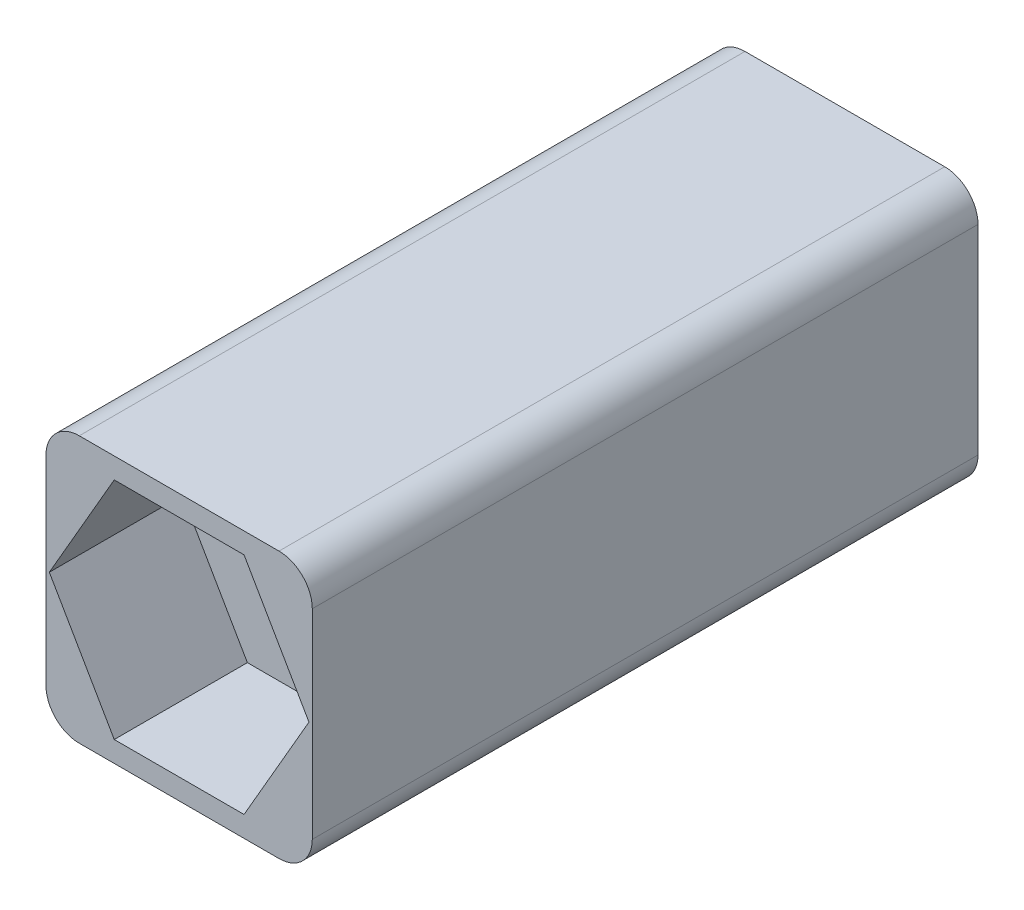
ISO-10303-21;
HEADER;
FILE_DESCRIPTION(('STEP AP214'),'2;1');
FILE_NAME('part.step','',(''),(''),'','','');
FILE_SCHEMA(('AUTOMOTIVE_DESIGN { 1 0 10303 214 1 1 1 1 }'));
ENDSEC;
DATA;
#1=APPLICATION_CONTEXT('core data for automotive mechanical design processes');
#2=APPLICATION_PROTOCOL_DEFINITION('international standard','automotive_design',2000,#1);
#3=PRODUCT_CONTEXT('',#1,'mechanical');
#4=PRODUCT('Part','Part','',(#3));
#5=PRODUCT_RELATED_PRODUCT_CATEGORY('part','',(#4));
#6=PRODUCT_DEFINITION_FORMATION('','',#4);
#7=PRODUCT_DEFINITION_CONTEXT('part definition',#1,'design');
#8=PRODUCT_DEFINITION('design','',#6,#7);
#9=PRODUCT_DEFINITION_SHAPE('','',#8);
#10=(LENGTH_UNIT() NAMED_UNIT(*) SI_UNIT(.MILLI.,.METRE.));
#11=(NAMED_UNIT(*) PLANE_ANGLE_UNIT() SI_UNIT($,.RADIAN.));
#12=(NAMED_UNIT(*) SI_UNIT($,.STERADIAN.) SOLID_ANGLE_UNIT());
#13=UNCERTAINTY_MEASURE_WITH_UNIT(LENGTH_MEASURE(1.E-05),#10,'distance_accuracy_value','');
#14=(GEOMETRIC_REPRESENTATION_CONTEXT(3) GLOBAL_UNCERTAINTY_ASSIGNED_CONTEXT((#13)) GLOBAL_UNIT_ASSIGNED_CONTEXT((#10,
#11,#12)) REPRESENTATION_CONTEXT('',''));
#15=CARTESIAN_POINT('',(0.,0.,0.));
#16=DIRECTION('',(0.,0.,1.));
#17=DIRECTION('',(1.,0.,0.));
#18=AXIS2_PLACEMENT_3D('',#15,#16,#17);
#19=CARTESIAN_POINT('',(1.39914914913894,0.658917954286227,0.));
#20=DIRECTION('',(0.,0.,1.));
#21=DIRECTION('',(1.,0.,0.));
#22=AXIS2_PLACEMENT_3D('',#19,#20,#21);
#23=CYLINDRICAL_SURFACE('',#22,2.);
#24=CARTESIAN_POINT('',(1.39914914913894,0.658917954286227,0.));
#25=DIRECTION('',(0.,0.,1.));
#26=DIRECTION('',(1.,0.,0.));
#27=AXIS2_PLACEMENT_3D('',#24,#25,#26);
#28=CIRCLE('',#27,2.);
#29=CARTESIAN_POINT('',(3.39914914913895,0.658917954286227,0.));
#30=VERTEX_POINT('',#29);
#31=EDGE_CURVE('E210',#30,#30,#28,.T.);
#32=ORIENTED_EDGE('',*,*,#31,.F.);
#33=EDGE_LOOP('',(#32));
#34=FACE_BOUND('',#33,.T.);
#35=CARTESIAN_POINT('',(1.39914914913894,0.658917954286227,16.));
#36=DIRECTION('',(0.,0.,1.));
#37=DIRECTION('',(1.,0.,0.));
#38=AXIS2_PLACEMENT_3D('',#35,#36,#37);
#39=CIRCLE('',#38,2.);
#40=CARTESIAN_POINT('',(3.39914914913895,0.658917954286227,16.));
#41=VERTEX_POINT('',#40);
#42=EDGE_CURVE('E169',#41,#41,#39,.F.);
#43=ORIENTED_EDGE('',*,*,#42,.F.);
#44=EDGE_LOOP('',(#43));
#45=FACE_BOUND('',#44,.T.);
#46=ADVANCED_FACE('F39',(#34,#45),#23,.F.);
#47=CARTESIAN_POINT('',(-2.60085085086106,4.65891795428623,20.));
#48=DIRECTION('',(1.,0.,0.));
#49=DIRECTION('',(0.,1.,0.));
#50=AXIS2_PLACEMENT_3D('',#47,#48,#49);
#51=PLANE('',#50);
#52=DIRECTION('',(0.,-1.,0.));
#53=VECTOR('',#52,1.);
#54=CARTESIAN_POINT('',(-2.60085085086106,4.65891795428623,0.));
#55=LINE('',#54,#53);
#56=CARTESIAN_POINT('',(-2.60085085086106,3.65891795428623,0.));
#57=VERTEX_POINT('',#56);
#58=CARTESIAN_POINT('',(-2.60085085086106,-2.34108204571377,0.));
#59=VERTEX_POINT('',#58);
#60=EDGE_CURVE('E225',#57,#59,#55,.T.);
#61=ORIENTED_EDGE('',*,*,#60,.T.);
#62=DIRECTION('',(0.,0.,-1.));
#63=VECTOR('',#62,1.);
#64=CARTESIAN_POINT('',(-2.60085085086106,-2.34108204571377,20.));
#65=LINE('',#64,#63);
#66=CARTESIAN_POINT('',(-2.60085085086106,-2.34108204571377,20.));
#67=VERTEX_POINT('',#66);
#68=EDGE_CURVE('E48',#59,#67,#65,.F.);
#69=ORIENTED_EDGE('',*,*,#68,.T.);
#70=DIRECTION('',(0.,-1.,0.));
#71=VECTOR('',#70,1.);
#72=CARTESIAN_POINT('',(-2.60085085086106,4.65891795428623,20.));
#73=LINE('',#72,#71);
#74=CARTESIAN_POINT('',(-2.60085085086106,3.65891795428623,20.));
#75=VERTEX_POINT('',#74);
#76=EDGE_CURVE('E226',#75,#67,#73,.T.);
#77=ORIENTED_EDGE('',*,*,#76,.F.);
#78=DIRECTION('',(0.,0.,-1.));
#79=VECTOR('',#78,1.);
#80=CARTESIAN_POINT('',(-2.60085085086106,3.65891795428623,20.));
#81=LINE('',#80,#79);
#82=EDGE_CURVE('E290',#75,#57,#81,.T.);
#83=ORIENTED_EDGE('',*,*,#82,.T.);
#84=EDGE_LOOP('',(#61,#69,#77,#83));
#85=FACE_BOUND('',#84,.T.);
#86=ADVANCED_FACE('F332',(#85),#51,.F.);
#87=CARTESIAN_POINT('',(-2.60085085086106,-3.34108204571377,20.));
#88=DIRECTION('',(0.,1.,0.));
#89=DIRECTION('',(0.,0.,1.));
#90=AXIS2_PLACEMENT_3D('',#87,#88,#89);
#91=PLANE('',#90);
#92=DIRECTION('',(1.,0.,0.));
#93=VECTOR('',#92,1.);
#94=CARTESIAN_POINT('',(-2.60085085086106,-3.34108204571377,20.));
#95=LINE('',#94,#93);
#96=CARTESIAN_POINT('',(-1.60085085086106,-3.34108204571377,20.));
#97=VERTEX_POINT('',#96);
#98=CARTESIAN_POINT('',(4.39914914913894,-3.34108204571377,20.));
#99=VERTEX_POINT('',#98);
#100=EDGE_CURVE('E229',#97,#99,#95,.T.);
#101=ORIENTED_EDGE('',*,*,#100,.F.);
#102=DIRECTION('',(0.,0.,-1.));
#103=VECTOR('',#102,1.);
#104=CARTESIAN_POINT('',(-1.60085085086106,-3.34108204571377,20.));
#105=LINE('',#104,#103);
#106=CARTESIAN_POINT('',(-1.60085085086106,-3.34108204571377,0.));
#107=VERTEX_POINT('',#106);
#108=EDGE_CURVE('E294',#97,#107,#105,.T.);
#109=ORIENTED_EDGE('',*,*,#108,.T.);
#110=DIRECTION('',(1.,0.,0.));
#111=VECTOR('',#110,1.);
#112=CARTESIAN_POINT('',(-2.60085085086106,-3.34108204571377,0.));
#113=LINE('',#112,#111);
#114=CARTESIAN_POINT('',(4.39914914913894,-3.34108204571377,0.));
#115=VERTEX_POINT('',#114);
#116=EDGE_CURVE('E244',#107,#115,#113,.T.);
#117=ORIENTED_EDGE('',*,*,#116,.T.);
#118=DIRECTION('',(0.,0.,-1.));
#119=VECTOR('',#118,1.);
#120=CARTESIAN_POINT('',(4.39914914913894,-3.34108204571377,20.));
#121=LINE('',#120,#119);
#122=EDGE_CURVE('E270',#115,#99,#121,.F.);
#123=ORIENTED_EDGE('',*,*,#122,.T.);
#124=EDGE_LOOP('',(#101,#109,#117,#123));
#125=FACE_BOUND('',#124,.T.);
#126=ADVANCED_FACE('F303',(#125),#91,.F.);
#127=CARTESIAN_POINT('',(5.39914914913894,4.65891795428623,20.));
#128=DIRECTION('',(-1.,0.,0.));
#129=DIRECTION('',(0.,0.,1.));
#130=AXIS2_PLACEMENT_3D('',#127,#128,#129);
#131=PLANE('',#130);
#132=DIRECTION('',(0.,1.,0.));
#133=VECTOR('',#132,1.);
#134=CARTESIAN_POINT('',(5.39914914913894,4.65891795428623,20.));
#135=LINE('',#134,#133);
#136=CARTESIAN_POINT('',(5.39914914913894,-2.34108204571377,20.));
#137=VERTEX_POINT('',#136);
#138=CARTESIAN_POINT('',(5.39914914913894,3.65891795428623,20.));
#139=VERTEX_POINT('',#138);
#140=EDGE_CURVE('E233',#137,#139,#135,.T.);
#141=ORIENTED_EDGE('',*,*,#140,.F.);
#142=DIRECTION('',(0.,0.,-1.));
#143=VECTOR('',#142,1.);
#144=CARTESIAN_POINT('',(5.39914914913894,-2.34108204571377,20.));
#145=LINE('',#144,#143);
#146=CARTESIAN_POINT('',(5.39914914913894,-2.34108204571377,0.));
#147=VERTEX_POINT('',#146);
#148=EDGE_CURVE('E256',#137,#147,#145,.T.);
#149=ORIENTED_EDGE('',*,*,#148,.T.);
#150=DIRECTION('',(0.,1.,0.));
#151=VECTOR('',#150,1.);
#152=CARTESIAN_POINT('',(5.39914914913894,4.65891795428623,0.));
#153=LINE('',#152,#151);
#154=CARTESIAN_POINT('',(5.39914914913894,3.65891795428623,0.));
#155=VERTEX_POINT('',#154);
#156=EDGE_CURVE('E247',#147,#155,#153,.T.);
#157=ORIENTED_EDGE('',*,*,#156,.T.);
#158=DIRECTION('',(0.,0.,-1.));
#159=VECTOR('',#158,1.);
#160=CARTESIAN_POINT('',(5.39914914913894,3.65891795428623,20.));
#161=LINE('',#160,#159);
#162=EDGE_CURVE('E241',#155,#139,#161,.F.);
#163=ORIENTED_EDGE('',*,*,#162,.T.);
#164=EDGE_LOOP('',(#141,#149,#157,#163));
#165=FACE_BOUND('',#164,.T.);
#166=ADVANCED_FACE('F318',(#165),#131,.F.);
#167=CARTESIAN_POINT('',(-2.60085085086106,4.65891795428623,20.));
#168=DIRECTION('',(0.,-1.,0.));
#169=DIRECTION('',(0.,0.,-1.));
#170=AXIS2_PLACEMENT_3D('',#167,#168,#169);
#171=PLANE('',#170);
#172=DIRECTION('',(-1.,0.,0.));
#173=VECTOR('',#172,1.);
#174=CARTESIAN_POINT('',(-2.60085085086106,4.65891795428623,20.));
#175=LINE('',#174,#173);
#176=CARTESIAN_POINT('',(4.39914914913894,4.65891795428623,20.));
#177=VERTEX_POINT('',#176);
#178=CARTESIAN_POINT('',(-1.60085085086106,4.65891795428623,20.));
#179=VERTEX_POINT('',#178);
#180=EDGE_CURVE('E237',#177,#179,#175,.T.);
#181=ORIENTED_EDGE('',*,*,#180,.F.);
#182=DIRECTION('',(0.,0.,-1.));
#183=VECTOR('',#182,1.);
#184=CARTESIAN_POINT('',(4.39914914913894,4.65891795428623,20.));
#185=LINE('',#184,#183);
#186=CARTESIAN_POINT('',(4.39914914913894,4.65891795428623,0.));
#187=VERTEX_POINT('',#186);
#188=EDGE_CURVE('E286',#177,#187,#185,.T.);
#189=ORIENTED_EDGE('',*,*,#188,.T.);
#190=DIRECTION('',(-1.,0.,0.));
#191=VECTOR('',#190,1.);
#192=CARTESIAN_POINT('',(-2.60085085086106,4.65891795428623,0.));
#193=LINE('',#192,#191);
#194=CARTESIAN_POINT('',(-1.60085085086106,4.65891795428623,0.));
#195=VERTEX_POINT('',#194);
#196=EDGE_CURVE('E230',#187,#195,#193,.T.);
#197=ORIENTED_EDGE('',*,*,#196,.T.);
#198=DIRECTION('',(0.,0.,-1.));
#199=VECTOR('',#198,1.);
#200=CARTESIAN_POINT('',(-1.60085085086106,4.65891795428623,20.));
#201=LINE('',#200,#199);
#202=EDGE_CURVE('E283',#195,#179,#201,.F.);
#203=ORIENTED_EDGE('',*,*,#202,.T.);
#204=EDGE_LOOP('',(#181,#189,#197,#203));
#205=FACE_BOUND('',#204,.T.);
#206=ADVANCED_FACE('F326',(#205),#171,.F.);
#207=CARTESIAN_POINT('',(0.,0.,20.));
#208=DIRECTION('',(0.,0.,1.));
#209=DIRECTION('',(1.,0.,0.));
#210=AXIS2_PLACEMENT_3D('',#207,#208,#209);
#211=PLANE('',#210);
#212=DIRECTION('',(-1.,0.,0.));
#213=VECTOR('',#212,1.);
#214=CARTESIAN_POINT('',(0.,4.03641702904554,20.));
#215=LINE('',#214,#213);
#216=CARTESIAN_POINT('',(3.34914914913895,4.03641702904554,20.));
#217=VERTEX_POINT('',#216);
#218=CARTESIAN_POINT('',(-0.550850850861056,4.03641702904554,20.));
#219=VERTEX_POINT('',#218);
#220=EDGE_CURVE('E148',#217,#219,#215,.T.);
#221=ORIENTED_EDGE('',*,*,#220,.F.);
#222=DIRECTION('',(-0.5,0.866025403784439,0.));
#223=VECTOR('',#222,1.);
#224=CARTESIAN_POINT('',(4.25968170556498,2.45932837937007,20.));
#225=LINE('',#224,#223);
#226=CARTESIAN_POINT('',(5.29914914913894,0.658917954286227,20.));
#227=VERTEX_POINT('',#226);
#228=EDGE_CURVE('E173',#227,#217,#225,.T.);
#229=ORIENTED_EDGE('',*,*,#228,.F.);
#230=DIRECTION('',(0.5,0.866025403784439,0.));
#231=VECTOR('',#230,1.);
#232=CARTESIAN_POINT('',(3.68904201814344,-2.12986940222695,20.));
#233=LINE('',#232,#231);
#234=CARTESIAN_POINT('',(3.34914914913894,-2.71858112047308,20.));
#235=VERTEX_POINT('',#234);
#236=EDGE_CURVE('E200',#235,#227,#233,.T.);
#237=ORIENTED_EDGE('',*,*,#236,.F.);
#238=DIRECTION('',(1.,0.,0.));
#239=VECTOR('',#238,1.);
#240=CARTESIAN_POINT('',(0.,-2.71858112047308,20.));
#241=LINE('',#240,#239);
#242=CARTESIAN_POINT('',(-0.550850850861054,-2.71858112047308,20.));
#243=VERTEX_POINT('',#242);
#244=EDGE_CURVE('E196',#243,#235,#241,.T.);
#245=ORIENTED_EDGE('',*,*,#244,.F.);
#246=DIRECTION('',(0.5,-0.866025403784439,0.));
#247=VECTOR('',#246,1.);
#248=CARTESIAN_POINT('',(-1.59031829443502,-0.918170695389245,20.));
#249=LINE('',#248,#247);
#250=CARTESIAN_POINT('',(-2.50085085086106,0.658917954286226,20.));
#251=VERTEX_POINT('',#250);
#252=EDGE_CURVE('E192',#251,#243,#249,.T.);
#253=ORIENTED_EDGE('',*,*,#252,.F.);
#254=DIRECTION('',(-0.5,-0.866025403784439,0.));
#255=VECTOR('',#254,1.);
#256=CARTESIAN_POINT('',(-2.16095798185656,1.24762967253236,20.));
#257=LINE('',#256,#255);
#258=EDGE_CURVE('E189',#219,#251,#257,.T.);
#259=ORIENTED_EDGE('',*,*,#258,.F.);
#260=EDGE_LOOP('',(#221,#229,#237,#245,#253,#259));
#261=FACE_BOUND('',#260,.T.);
#262=ORIENTED_EDGE('',*,*,#76,.T.);
#263=CARTESIAN_POINT('',(-1.60085085086106,-2.34108204571377,20.));
#264=DIRECTION('',(0.,0.,1.));
#265=DIRECTION('',(1.,0.,0.));
#266=AXIS2_PLACEMENT_3D('',#263,#264,#265);
#267=CIRCLE('',#266,1.);
#268=EDGE_CURVE('E11',#67,#97,#267,.T.);
#269=ORIENTED_EDGE('',*,*,#268,.T.);
#270=ORIENTED_EDGE('',*,*,#100,.T.);
#271=CARTESIAN_POINT('',(4.39914914913894,-2.34108204571377,20.));
#272=DIRECTION('',(0.,0.,1.));
#273=DIRECTION('',(1.,0.,0.));
#274=AXIS2_PLACEMENT_3D('',#271,#272,#273);
#275=CIRCLE('',#274,1.);
#276=EDGE_CURVE('E280',#99,#137,#275,.T.);
#277=ORIENTED_EDGE('',*,*,#276,.T.);
#278=ORIENTED_EDGE('',*,*,#140,.T.);
#279=CARTESIAN_POINT('',(4.39914914913894,3.65891795428623,20.));
#280=DIRECTION('',(0.,0.,1.));
#281=DIRECTION('',(1.,0.,0.));
#282=AXIS2_PLACEMENT_3D('',#279,#280,#281);
#283=CIRCLE('',#282,1.);
#284=EDGE_CURVE('E277',#139,#177,#283,.T.);
#285=ORIENTED_EDGE('',*,*,#284,.T.);
#286=ORIENTED_EDGE('',*,*,#180,.T.);
#287=CARTESIAN_POINT('',(-1.60085085086106,3.65891795428623,20.));
#288=DIRECTION('',(0.,0.,1.));
#289=DIRECTION('',(1.,0.,0.));
#290=AXIS2_PLACEMENT_3D('',#287,#288,#289);
#291=CIRCLE('',#290,1.);
#292=EDGE_CURVE('E274',#179,#75,#291,.T.);
#293=ORIENTED_EDGE('',*,*,#292,.T.);
#294=EDGE_LOOP('',(#262,#269,#270,#277,#278,#285,#286,#293));
#295=FACE_BOUND('',#294,.T.);
#296=ADVANCED_FACE('F315',(#261,#295),#211,.T.);
#297=CARTESIAN_POINT('',(0.,0.,0.));
#298=DIRECTION('',(0.,0.,1.));
#299=DIRECTION('',(1.,0.,0.));
#300=AXIS2_PLACEMENT_3D('',#297,#298,#299);
#301=PLANE('',#300);
#302=ORIENTED_EDGE('',*,*,#31,.T.);
#303=EDGE_LOOP('',(#302));
#304=FACE_BOUND('',#303,.T.);
#305=ORIENTED_EDGE('',*,*,#116,.F.);
#306=CARTESIAN_POINT('',(-1.60085085086106,-2.34108204571377,0.));
#307=DIRECTION('',(0.,0.,1.));
#308=DIRECTION('',(1.,0.,0.));
#309=AXIS2_PLACEMENT_3D('',#306,#307,#308);
#310=CIRCLE('',#309,1.);
#311=EDGE_CURVE('E62',#107,#59,#310,.F.);
#312=ORIENTED_EDGE('',*,*,#311,.T.);
#313=ORIENTED_EDGE('',*,*,#60,.F.);
#314=CARTESIAN_POINT('',(-1.60085085086106,3.65891795428623,0.));
#315=DIRECTION('',(0.,0.,1.));
#316=DIRECTION('',(1.,0.,0.));
#317=AXIS2_PLACEMENT_3D('',#314,#315,#316);
#318=CIRCLE('',#317,1.);
#319=EDGE_CURVE('E260',#57,#195,#318,.F.);
#320=ORIENTED_EDGE('',*,*,#319,.T.);
#321=ORIENTED_EDGE('',*,*,#196,.F.);
#322=CARTESIAN_POINT('',(4.39914914913894,3.65891795428623,0.));
#323=DIRECTION('',(0.,0.,1.));
#324=DIRECTION('',(1.,0.,0.));
#325=AXIS2_PLACEMENT_3D('',#322,#323,#324);
#326=CIRCLE('',#325,1.);
#327=EDGE_CURVE('E263',#187,#155,#326,.F.);
#328=ORIENTED_EDGE('',*,*,#327,.T.);
#329=ORIENTED_EDGE('',*,*,#156,.F.);
#330=CARTESIAN_POINT('',(4.39914914913894,-2.34108204571377,0.));
#331=DIRECTION('',(0.,0.,1.));
#332=DIRECTION('',(1.,0.,0.));
#333=AXIS2_PLACEMENT_3D('',#330,#331,#332);
#334=CIRCLE('',#333,1.);
#335=EDGE_CURVE('E266',#147,#115,#334,.F.);
#336=ORIENTED_EDGE('',*,*,#335,.T.);
#337=EDGE_LOOP('',(#305,#312,#313,#320,#321,#328,#329,#336));
#338=FACE_BOUND('',#337,.T.);
#339=ADVANCED_FACE('F306',(#304,#338),#301,.F.);
#340=CARTESIAN_POINT('',(0.,4.03641702904554,16.));
#341=DIRECTION('',(0.,1.,0.));
#342=DIRECTION('',(-1.,0.,0.));
#343=AXIS2_PLACEMENT_3D('',#340,#341,#342);
#344=PLANE('',#343);
#345=ORIENTED_EDGE('',*,*,#220,.T.);
#346=DIRECTION('',(0.,0.,1.));
#347=VECTOR('',#346,1.);
#348=CARTESIAN_POINT('',(-0.550850850861056,4.03641702904554,16.));
#349=LINE('',#348,#347);
#350=CARTESIAN_POINT('',(-0.550850850861056,4.03641702904554,16.));
#351=VERTEX_POINT('',#350);
#352=EDGE_CURVE('E141',#351,#219,#349,.T.);
#353=ORIENTED_EDGE('',*,*,#352,.F.);
#354=DIRECTION('',(-1.,0.,0.));
#355=VECTOR('',#354,1.);
#356=CARTESIAN_POINT('',(0.,4.03641702904554,16.));
#357=LINE('',#356,#355);
#358=CARTESIAN_POINT('',(3.34914914913895,4.03641702904554,16.));
#359=VERTEX_POINT('',#358);
#360=EDGE_CURVE('E145',#359,#351,#357,.T.);
#361=ORIENTED_EDGE('',*,*,#360,.F.);
#362=DIRECTION('',(0.,0.,1.));
#363=VECTOR('',#362,1.);
#364=CARTESIAN_POINT('',(3.34914914913895,4.03641702904554,16.));
#365=LINE('',#364,#363);
#366=EDGE_CURVE('E207',#359,#217,#365,.T.);
#367=ORIENTED_EDGE('',*,*,#366,.T.);
#368=EDGE_LOOP('',(#345,#353,#361,#367));
#369=FACE_BOUND('',#368,.T.);
#370=ADVANCED_FACE('F143',(#369),#344,.F.);
#371=CARTESIAN_POINT('',(4.25968170556498,2.45932837937007,16.));
#372=DIRECTION('',(0.866025403784439,0.5,0.));
#373=DIRECTION('',(-0.5,0.866025403784439,0.));
#374=AXIS2_PLACEMENT_3D('',#371,#372,#373);
#375=PLANE('',#374);
#376=ORIENTED_EDGE('',*,*,#228,.T.);
#377=ORIENTED_EDGE('',*,*,#366,.F.);
#378=DIRECTION('',(-0.5,0.866025403784439,0.));
#379=VECTOR('',#378,1.);
#380=CARTESIAN_POINT('',(4.25968170556498,2.45932837937007,16.));
#381=LINE('',#380,#379);
#382=CARTESIAN_POINT('',(5.29914914913894,0.658917954286227,16.));
#383=VERTEX_POINT('',#382);
#384=EDGE_CURVE('E154',#383,#359,#381,.T.);
#385=ORIENTED_EDGE('',*,*,#384,.F.);
#386=DIRECTION('',(0.,0.,1.));
#387=VECTOR('',#386,1.);
#388=CARTESIAN_POINT('',(5.29914914913894,0.658917954286227,16.));
#389=LINE('',#388,#387);
#390=EDGE_CURVE('E211',#383,#227,#389,.T.);
#391=ORIENTED_EDGE('',*,*,#390,.T.);
#392=EDGE_LOOP('',(#376,#377,#385,#391));
#393=FACE_BOUND('',#392,.T.);
#394=ADVANCED_FACE('F412',(#393),#375,.F.);
#395=CARTESIAN_POINT('',(3.68904201814344,-2.12986940222695,16.));
#396=DIRECTION('',(0.866025403784439,-0.5,0.));
#397=DIRECTION('',(0.5,0.866025403784439,0.));
#398=AXIS2_PLACEMENT_3D('',#395,#396,#397);
#399=PLANE('',#398);
#400=ORIENTED_EDGE('',*,*,#236,.T.);
#401=ORIENTED_EDGE('',*,*,#390,.F.);
#402=DIRECTION('',(0.5,0.866025403784439,0.));
#403=VECTOR('',#402,1.);
#404=CARTESIAN_POINT('',(3.68904201814344,-2.12986940222695,16.));
#405=LINE('',#404,#403);
#406=CARTESIAN_POINT('',(3.34914914913894,-2.71858112047308,16.));
#407=VERTEX_POINT('',#406);
#408=EDGE_CURVE('E182',#407,#383,#405,.T.);
#409=ORIENTED_EDGE('',*,*,#408,.F.);
#410=DIRECTION('',(0.,0.,1.));
#411=VECTOR('',#410,1.);
#412=CARTESIAN_POINT('',(3.34914914913894,-2.71858112047308,16.));
#413=LINE('',#412,#411);
#414=EDGE_CURVE('E214',#407,#235,#413,.T.);
#415=ORIENTED_EDGE('',*,*,#414,.T.);
#416=EDGE_LOOP('',(#400,#401,#409,#415));
#417=FACE_BOUND('',#416,.T.);
#418=ADVANCED_FACE('F418',(#417),#399,.F.);
#419=CARTESIAN_POINT('',(0.,-2.71858112047308,16.));
#420=DIRECTION('',(0.,-1.,0.));
#421=DIRECTION('',(0.,0.,-1.));
#422=AXIS2_PLACEMENT_3D('',#419,#420,#421);
#423=PLANE('',#422);
#424=ORIENTED_EDGE('',*,*,#244,.T.);
#425=ORIENTED_EDGE('',*,*,#414,.F.);
#426=DIRECTION('',(1.,0.,0.));
#427=VECTOR('',#426,1.);
#428=CARTESIAN_POINT('',(0.,-2.71858112047308,16.));
#429=LINE('',#428,#427);
#430=CARTESIAN_POINT('',(-0.550850850861054,-2.71858112047308,16.));
#431=VERTEX_POINT('',#430);
#432=EDGE_CURVE('E178',#431,#407,#429,.T.);
#433=ORIENTED_EDGE('',*,*,#432,.F.);
#434=DIRECTION('',(0.,0.,1.));
#435=VECTOR('',#434,1.);
#436=CARTESIAN_POINT('',(-0.550850850861054,-2.71858112047308,16.));
#437=LINE('',#436,#435);
#438=EDGE_CURVE('E217',#431,#243,#437,.T.);
#439=ORIENTED_EDGE('',*,*,#438,.T.);
#440=EDGE_LOOP('',(#424,#425,#433,#439));
#441=FACE_BOUND('',#440,.T.);
#442=ADVANCED_FACE('F426',(#441),#423,.F.);
#443=CARTESIAN_POINT('',(-1.59031829443502,-0.918170695389245,16.));
#444=DIRECTION('',(-0.866025403784438,-0.5,0.));
#445=DIRECTION('',(0.5,-0.866025403784439,0.));
#446=AXIS2_PLACEMENT_3D('',#443,#444,#445);
#447=PLANE('',#446);
#448=ORIENTED_EDGE('',*,*,#252,.T.);
#449=ORIENTED_EDGE('',*,*,#438,.F.);
#450=DIRECTION('',(0.5,-0.866025403784439,0.));
#451=VECTOR('',#450,1.);
#452=CARTESIAN_POINT('',(-1.59031829443502,-0.918170695389245,16.));
#453=LINE('',#452,#451);
#454=CARTESIAN_POINT('',(-2.50085085086106,0.658917954286226,16.));
#455=VERTEX_POINT('',#454);
#456=EDGE_CURVE('E163',#455,#431,#453,.T.);
#457=ORIENTED_EDGE('',*,*,#456,.F.);
#458=DIRECTION('',(0.,0.,1.));
#459=VECTOR('',#458,1.);
#460=CARTESIAN_POINT('',(-2.50085085086106,0.658917954286226,16.));
#461=LINE('',#460,#459);
#462=EDGE_CURVE('E153',#455,#251,#461,.T.);
#463=ORIENTED_EDGE('',*,*,#462,.T.);
#464=EDGE_LOOP('',(#448,#449,#457,#463));
#465=FACE_BOUND('',#464,.T.);
#466=ADVANCED_FACE('F434',(#465),#447,.F.);
#467=CARTESIAN_POINT('',(-2.16095798185656,1.24762967253236,16.));
#468=DIRECTION('',(-0.866025403784439,0.5,0.));
#469=DIRECTION('',(-0.5,-0.866025403784439,0.));
#470=AXIS2_PLACEMENT_3D('',#467,#468,#469);
#471=PLANE('',#470);
#472=ORIENTED_EDGE('',*,*,#258,.T.);
#473=ORIENTED_EDGE('',*,*,#462,.F.);
#474=DIRECTION('',(-0.5,-0.866025403784439,0.));
#475=VECTOR('',#474,1.);
#476=CARTESIAN_POINT('',(-2.16095798185656,1.24762967253236,16.));
#477=LINE('',#476,#475);
#478=EDGE_CURVE('E157',#351,#455,#477,.T.);
#479=ORIENTED_EDGE('',*,*,#478,.F.);
#480=ORIENTED_EDGE('',*,*,#352,.T.);
#481=EDGE_LOOP('',(#472,#473,#479,#480));
#482=FACE_BOUND('',#481,.T.);
#483=ADVANCED_FACE('F158',(#482),#471,.F.);
#484=CARTESIAN_POINT('',(0.,0.,16.));
#485=DIRECTION('',(0.,0.,1.));
#486=DIRECTION('',(1.,0.,0.));
#487=AXIS2_PLACEMENT_3D('',#484,#485,#486);
#488=PLANE('',#487);
#489=ORIENTED_EDGE('',*,*,#42,.T.);
#490=EDGE_LOOP('',(#489));
#491=FACE_BOUND('',#490,.T.);
#492=ORIENTED_EDGE('',*,*,#360,.T.);
#493=ORIENTED_EDGE('',*,*,#478,.T.);
#494=ORIENTED_EDGE('',*,*,#456,.T.);
#495=ORIENTED_EDGE('',*,*,#432,.T.);
#496=ORIENTED_EDGE('',*,*,#408,.T.);
#497=ORIENTED_EDGE('',*,*,#384,.T.);
#498=EDGE_LOOP('',(#492,#493,#494,#495,#496,#497));
#499=FACE_BOUND('',#498,.T.);
#500=ADVANCED_FACE('F165',(#491,#499),#488,.T.);
#501=CARTESIAN_POINT('',(4.39914914913894,-2.34108204571377,20.));
#502=DIRECTION('',(0.,0.,-1.));
#503=DIRECTION('',(-1.,0.,0.));
#504=AXIS2_PLACEMENT_3D('',#501,#502,#503);
#505=CYLINDRICAL_SURFACE('',#504,1.);
#506=ORIENTED_EDGE('',*,*,#276,.F.);
#507=ORIENTED_EDGE('',*,*,#122,.F.);
#508=ORIENTED_EDGE('',*,*,#335,.F.);
#509=ORIENTED_EDGE('',*,*,#148,.F.);
#510=EDGE_LOOP('',(#506,#507,#508,#509));
#511=FACE_BOUND('',#510,.T.);
#512=ADVANCED_FACE('F312',(#511),#505,.T.);
#513=CARTESIAN_POINT('',(4.39914914913894,3.65891795428623,20.));
#514=DIRECTION('',(0.,0.,-1.));
#515=DIRECTION('',(-1.,0.,0.));
#516=AXIS2_PLACEMENT_3D('',#513,#514,#515);
#517=CYLINDRICAL_SURFACE('',#516,1.);
#518=ORIENTED_EDGE('',*,*,#284,.F.);
#519=ORIENTED_EDGE('',*,*,#162,.F.);
#520=ORIENTED_EDGE('',*,*,#327,.F.);
#521=ORIENTED_EDGE('',*,*,#188,.F.);
#522=EDGE_LOOP('',(#518,#519,#520,#521));
#523=FACE_BOUND('',#522,.T.);
#524=ADVANCED_FACE('F321',(#523),#517,.T.);
#525=CARTESIAN_POINT('',(-1.60085085086106,3.65891795428623,20.));
#526=DIRECTION('',(0.,0.,-1.));
#527=DIRECTION('',(-1.,0.,0.));
#528=AXIS2_PLACEMENT_3D('',#525,#526,#527);
#529=CYLINDRICAL_SURFACE('',#528,1.);
#530=ORIENTED_EDGE('',*,*,#292,.F.);
#531=ORIENTED_EDGE('',*,*,#202,.F.);
#532=ORIENTED_EDGE('',*,*,#319,.F.);
#533=ORIENTED_EDGE('',*,*,#82,.F.);
#534=EDGE_LOOP('',(#530,#531,#532,#533));
#535=FACE_BOUND('',#534,.T.);
#536=ADVANCED_FACE('F330',(#535),#529,.T.);
#537=CARTESIAN_POINT('',(-1.60085085086106,-2.34108204571377,20.));
#538=DIRECTION('',(0.,0.,-1.));
#539=DIRECTION('',(-1.,0.,0.));
#540=AXIS2_PLACEMENT_3D('',#537,#538,#539);
#541=CYLINDRICAL_SURFACE('',#540,1.);
#542=ORIENTED_EDGE('',*,*,#268,.F.);
#543=ORIENTED_EDGE('',*,*,#68,.F.);
#544=ORIENTED_EDGE('',*,*,#311,.F.);
#545=ORIENTED_EDGE('',*,*,#108,.F.);
#546=EDGE_LOOP('',(#542,#543,#544,#545));
#547=FACE_BOUND('',#546,.T.);
#548=ADVANCED_FACE('F41',(#547),#541,.T.);
#549=CLOSED_SHELL('',(#46,#86,#126,#166,#206,#296,#339,#370,#394,#418,#442,#466,#483,#500,#512,
#524,#536,#548));
#550=MANIFOLD_SOLID_BREP('B2',#549);
#551=ADVANCED_BREP_SHAPE_REPRESENTATION('',(#18,#550),#14);
#552=SHAPE_DEFINITION_REPRESENTATION(#9,#551);
ENDSEC;
END-ISO-10303-21;
